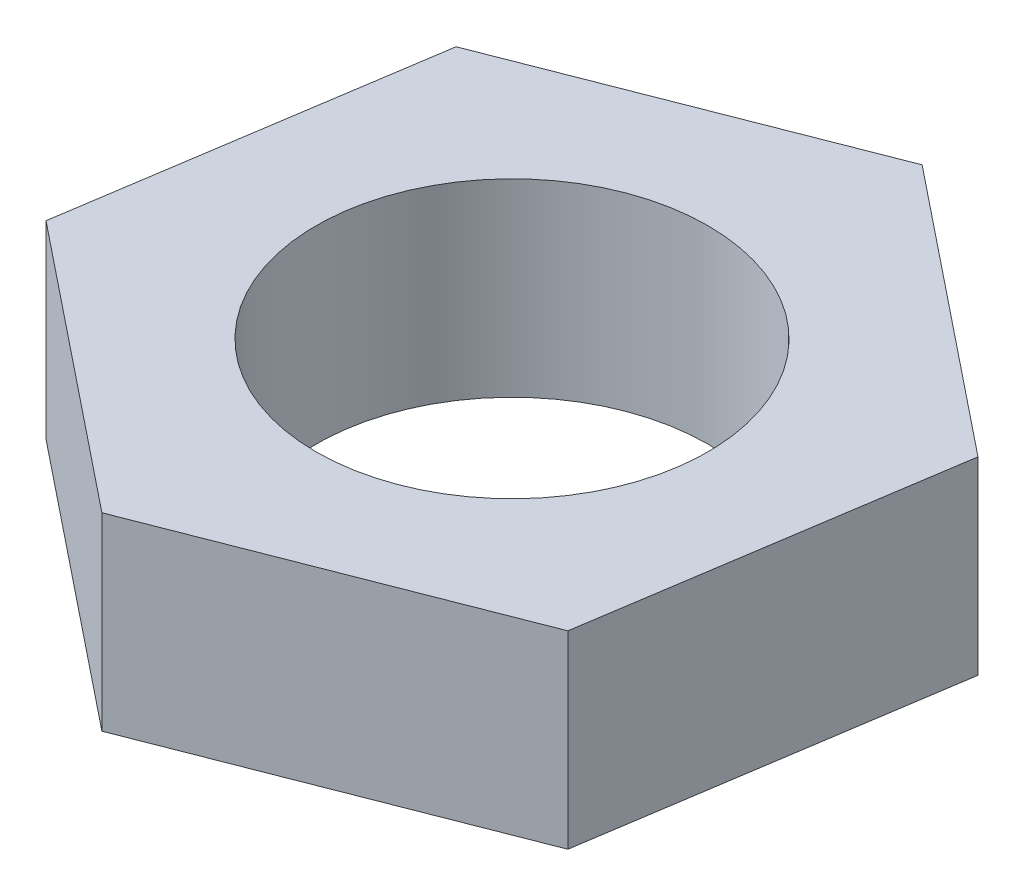
ISO-10303-21;
HEADER;
FILE_DESCRIPTION(('STEP AP214'),'2;1');
FILE_NAME('part.step','',(''),(''),'','','');
FILE_SCHEMA(('AUTOMOTIVE_DESIGN { 1 0 10303 214 1 1 1 1 }'));
ENDSEC;
DATA;
#1=APPLICATION_CONTEXT('core data for automotive mechanical design processes');
#2=APPLICATION_PROTOCOL_DEFINITION('international standard','automotive_design',2000,#1);
#3=PRODUCT_CONTEXT('',#1,'mechanical');
#4=PRODUCT('Part','Part','',(#3));
#5=PRODUCT_RELATED_PRODUCT_CATEGORY('part','',(#4));
#6=PRODUCT_DEFINITION_FORMATION('','',#4);
#7=PRODUCT_DEFINITION_CONTEXT('part definition',#1,'design');
#8=PRODUCT_DEFINITION('design','',#6,#7);
#9=PRODUCT_DEFINITION_SHAPE('','',#8);
#10=(LENGTH_UNIT() NAMED_UNIT(*) SI_UNIT(.MILLI.,.METRE.));
#11=(NAMED_UNIT(*) PLANE_ANGLE_UNIT() SI_UNIT($,.RADIAN.));
#12=(NAMED_UNIT(*) SI_UNIT($,.STERADIAN.) SOLID_ANGLE_UNIT());
#13=UNCERTAINTY_MEASURE_WITH_UNIT(LENGTH_MEASURE(1.E-05),#10,'distance_accuracy_value','');
#14=(GEOMETRIC_REPRESENTATION_CONTEXT(3) GLOBAL_UNCERTAINTY_ASSIGNED_CONTEXT((#13)) GLOBAL_UNIT_ASSIGNED_CONTEXT((#10,
#11,#12)) REPRESENTATION_CONTEXT('',''));
#15=CARTESIAN_POINT('',(0.,0.,0.));
#16=DIRECTION('',(0.,0.,1.));
#17=DIRECTION('',(1.,0.,0.));
#18=AXIS2_PLACEMENT_3D('',#15,#16,#17);
#19=CARTESIAN_POINT('',(-10.3923048454133,7.,-8.32408394547586));
#20=DIRECTION('',(0.988509150519784,0.,0.151161037766536));
#21=DIRECTION('',(0.151161037766536,0.,-0.988509150519784));
#22=AXIS2_PLACEMENT_3D('',#19,#20,#21);
#23=PLANE('',#22);
#24=DIRECTION('',(-0.151161037766536,0.,0.988509150519783));
#25=VECTOR('',#24,1.);
#26=CARTESIAN_POINT('',(-10.3923048454133,0.,-8.32408394547586));
#27=LINE('',#26,#25);
#28=CARTESIAN_POINT('',(-10.3923048454133,0.,-8.32408394547586));
#29=VERTEX_POINT('',#28);
#30=CARTESIAN_POINT('',(-12.4050205827229,0.,4.83795802726207));
#31=VERTEX_POINT('',#30);
#32=EDGE_CURVE('E118',#29,#31,#27,.T.);
#33=ORIENTED_EDGE('',*,*,#32,.T.);
#34=DIRECTION('',(0.,-1.,0.));
#35=VECTOR('',#34,1.);
#36=CARTESIAN_POINT('',(-12.4050205827229,7.,4.83795802726207));
#37=LINE('',#36,#35);
#38=CARTESIAN_POINT('',(-12.4050205827229,7.,4.83795802726207));
#39=VERTEX_POINT('',#38);
#40=EDGE_CURVE('E11',#39,#31,#37,.T.);
#41=ORIENTED_EDGE('',*,*,#40,.F.);
#42=DIRECTION('',(-0.151161037766536,0.,0.988509150519783));
#43=VECTOR('',#42,1.);
#44=CARTESIAN_POINT('',(-10.3923048454133,7.,-8.32408394547586));
#45=LINE('',#44,#43);
#46=CARTESIAN_POINT('',(-10.3923048454133,7.,-8.32408394547586));
#47=VERTEX_POINT('',#46);
#48=EDGE_CURVE('E129',#47,#39,#45,.T.);
#49=ORIENTED_EDGE('',*,*,#48,.F.);
#50=DIRECTION('',(0.,-1.,0.));
#51=VECTOR('',#50,1.);
#52=CARTESIAN_POINT('',(-10.3923048454133,7.,-8.32408394547586));
#53=LINE('',#52,#51);
#54=EDGE_CURVE('E114',#47,#29,#53,.T.);
#55=ORIENTED_EDGE('',*,*,#54,.T.);
#56=EDGE_LOOP('',(#33,#41,#49,#55));
#57=FACE_BOUND('',#56,.T.);
#58=ADVANCED_FACE('F34',(#57),#23,.F.);
#59=CARTESIAN_POINT('',(-12.4050205827229,7.,4.83795802726207));
#60=DIRECTION('',(0.625163874028131,0.,-0.78049351734024));
#61=DIRECTION('',(-0.78049351734024,0.,-0.625163874028131));
#62=AXIS2_PLACEMENT_3D('',#59,#60,#61);
#63=PLANE('',#62);
#64=DIRECTION('',(0.78049351734024,0.,0.625163874028131));
#65=VECTOR('',#64,1.);
#66=CARTESIAN_POINT('',(-12.4050205827229,0.,4.83795802726207));
#67=LINE('',#66,#65);
#68=CARTESIAN_POINT('',(-2.01271573730966,0.,13.1620419727379));
#69=VERTEX_POINT('',#68);
#70=EDGE_CURVE('E121',#31,#69,#67,.T.);
#71=ORIENTED_EDGE('',*,*,#70,.T.);
#72=DIRECTION('',(0.,-1.,0.));
#73=VECTOR('',#72,1.);
#74=CARTESIAN_POINT('',(-2.01271573730966,7.,13.1620419727379));
#75=LINE('',#74,#73);
#76=CARTESIAN_POINT('',(-2.01271573730966,7.,13.1620419727379));
#77=VERTEX_POINT('',#76);
#78=EDGE_CURVE('E42',#77,#69,#75,.T.);
#79=ORIENTED_EDGE('',*,*,#78,.F.);
#80=DIRECTION('',(0.78049351734024,0.,0.625163874028131));
#81=VECTOR('',#80,1.);
#82=CARTESIAN_POINT('',(-12.4050205827229,7.,4.83795802726207));
#83=LINE('',#82,#81);
#84=EDGE_CURVE('E87',#39,#77,#83,.T.);
#85=ORIENTED_EDGE('',*,*,#84,.F.);
#86=ORIENTED_EDGE('',*,*,#40,.T.);
#87=EDGE_LOOP('',(#71,#79,#85,#86));
#88=FACE_BOUND('',#87,.T.);
#89=ADVANCED_FACE('F154',(#88),#63,.F.);
#90=CARTESIAN_POINT('',(-2.01271573730966,7.,13.1620419727379));
#91=DIRECTION('',(-0.363345276491653,0.,-0.931654555106776));
#92=DIRECTION('',(-0.931654555106776,0.,0.363345276491653));
#93=AXIS2_PLACEMENT_3D('',#90,#91,#92);
#94=PLANE('',#93);
#95=DIRECTION('',(0.931654555106776,0.,-0.363345276491653));
#96=VECTOR('',#95,1.);
#97=CARTESIAN_POINT('',(-2.01271573730966,0.,13.1620419727379));
#98=LINE('',#97,#96);
#99=CARTESIAN_POINT('',(10.3923048454133,0.,8.32408394547585));
#100=VERTEX_POINT('',#99);
#101=EDGE_CURVE('E124',#69,#100,#98,.T.);
#102=ORIENTED_EDGE('',*,*,#101,.T.);
#103=DIRECTION('',(0.,-1.,0.));
#104=VECTOR('',#103,1.);
#105=CARTESIAN_POINT('',(10.3923048454133,7.,8.32408394547585));
#106=LINE('',#105,#104);
#107=CARTESIAN_POINT('',(10.3923048454133,7.,8.32408394547585));
#108=VERTEX_POINT('',#107);
#109=EDGE_CURVE('E109',#108,#100,#106,.T.);
#110=ORIENTED_EDGE('',*,*,#109,.F.);
#111=DIRECTION('',(0.931654555106776,0.,-0.363345276491653));
#112=VECTOR('',#111,1.);
#113=CARTESIAN_POINT('',(-2.01271573730966,7.,13.1620419727379));
#114=LINE('',#113,#112);
#115=EDGE_CURVE('E100',#77,#108,#114,.T.);
#116=ORIENTED_EDGE('',*,*,#115,.F.);
#117=ORIENTED_EDGE('',*,*,#78,.T.);
#118=EDGE_LOOP('',(#102,#110,#116,#117));
#119=FACE_BOUND('',#118,.T.);
#120=ADVANCED_FACE('F135',(#119),#94,.F.);
#121=CARTESIAN_POINT('',(10.3923048454133,7.,8.32408394547585));
#122=DIRECTION('',(-0.988509150519783,0.,-0.151161037766536));
#123=DIRECTION('',(-0.151161037766536,0.,0.988509150519783));
#124=AXIS2_PLACEMENT_3D('',#121,#122,#123);
#125=PLANE('',#124);
#126=DIRECTION('',(0.151161037766536,0.,-0.988509150519784));
#127=VECTOR('',#126,1.);
#128=CARTESIAN_POINT('',(10.3923048454133,0.,8.32408394547585));
#129=LINE('',#128,#127);
#130=CARTESIAN_POINT('',(12.4050205827229,0.,-4.83795802726207));
#131=VERTEX_POINT('',#130);
#132=EDGE_CURVE('E108',#100,#131,#129,.T.);
#133=ORIENTED_EDGE('',*,*,#132,.T.);
#134=DIRECTION('',(0.,-1.,0.));
#135=VECTOR('',#134,1.);
#136=CARTESIAN_POINT('',(12.4050205827229,7.,-4.83795802726207));
#137=LINE('',#136,#135);
#138=CARTESIAN_POINT('',(12.4050205827229,7.,-4.83795802726207));
#139=VERTEX_POINT('',#138);
#140=EDGE_CURVE('E105',#139,#131,#137,.T.);
#141=ORIENTED_EDGE('',*,*,#140,.F.);
#142=DIRECTION('',(0.151161037766536,0.,-0.988509150519784));
#143=VECTOR('',#142,1.);
#144=CARTESIAN_POINT('',(10.3923048454133,7.,8.32408394547585));
#145=LINE('',#144,#143);
#146=EDGE_CURVE('E94',#108,#139,#145,.T.);
#147=ORIENTED_EDGE('',*,*,#146,.F.);
#148=ORIENTED_EDGE('',*,*,#109,.T.);
#149=EDGE_LOOP('',(#133,#141,#147,#148));
#150=FACE_BOUND('',#149,.T.);
#151=ADVANCED_FACE('F106',(#150),#125,.F.);
#152=CARTESIAN_POINT('',(12.4050205827229,7.,-4.83795802726207));
#153=DIRECTION('',(-0.625163874028131,0.,0.78049351734024));
#154=DIRECTION('',(0.78049351734024,0.,0.625163874028131));
#155=AXIS2_PLACEMENT_3D('',#152,#153,#154);
#156=PLANE('',#155);
#157=DIRECTION('',(-0.78049351734024,0.,-0.625163874028131));
#158=VECTOR('',#157,1.);
#159=CARTESIAN_POINT('',(12.4050205827229,0.,-4.83795802726207));
#160=LINE('',#159,#158);
#161=CARTESIAN_POINT('',(2.01271573730966,0.,-13.1620419727379));
#162=VERTEX_POINT('',#161);
#163=EDGE_CURVE('E73',#131,#162,#160,.T.);
#164=ORIENTED_EDGE('',*,*,#163,.T.);
#165=DIRECTION('',(0.,-1.,0.));
#166=VECTOR('',#165,1.);
#167=CARTESIAN_POINT('',(2.01271573730966,7.,-13.1620419727379));
#168=LINE('',#167,#166);
#169=CARTESIAN_POINT('',(2.01271573730966,7.,-13.1620419727379));
#170=VERTEX_POINT('',#169);
#171=EDGE_CURVE('E110',#170,#162,#168,.T.);
#172=ORIENTED_EDGE('',*,*,#171,.F.);
#173=DIRECTION('',(-0.78049351734024,0.,-0.625163874028131));
#174=VECTOR('',#173,1.);
#175=CARTESIAN_POINT('',(12.4050205827229,7.,-4.83795802726207));
#176=LINE('',#175,#174);
#177=EDGE_CURVE('E98',#139,#170,#176,.T.);
#178=ORIENTED_EDGE('',*,*,#177,.F.);
#179=ORIENTED_EDGE('',*,*,#140,.T.);
#180=EDGE_LOOP('',(#164,#172,#178,#179));
#181=FACE_BOUND('',#180,.T.);
#182=ADVANCED_FACE('F112',(#181),#156,.F.);
#183=CARTESIAN_POINT('',(2.01271573730966,7.,-13.1620419727379));
#184=DIRECTION('',(0.363345276491652,0.,0.931654555106776));
#185=DIRECTION('',(0.931654555106776,0.,-0.363345276491652));
#186=AXIS2_PLACEMENT_3D('',#183,#184,#185);
#187=PLANE('',#186);
#188=DIRECTION('',(-0.931654555106776,0.,0.363345276491652));
#189=VECTOR('',#188,1.);
#190=CARTESIAN_POINT('',(2.01271573730966,0.,-13.1620419727379));
#191=LINE('',#190,#189);
#192=EDGE_CURVE('E79',#162,#29,#191,.T.);
#193=ORIENTED_EDGE('',*,*,#192,.T.);
#194=ORIENTED_EDGE('',*,*,#54,.F.);
#195=DIRECTION('',(-0.931654555106776,0.,0.363345276491652));
#196=VECTOR('',#195,1.);
#197=CARTESIAN_POINT('',(2.01271573730966,7.,-13.1620419727379));
#198=LINE('',#197,#196);
#199=EDGE_CURVE('E50',#170,#47,#198,.T.);
#200=ORIENTED_EDGE('',*,*,#199,.F.);
#201=ORIENTED_EDGE('',*,*,#171,.T.);
#202=EDGE_LOOP('',(#193,#194,#200,#201));
#203=FACE_BOUND('',#202,.T.);
#204=ADVANCED_FACE('F142',(#203),#187,.F.);
#205=CARTESIAN_POINT('',(0.,7.,0.));
#206=DIRECTION('',(0.,1.,0.));
#207=DIRECTION('',(0.,0.,1.));
#208=AXIS2_PLACEMENT_3D('',#205,#206,#207);
#209=PLANE('',#208);
#210=CARTESIAN_POINT('',(0.,7.,0.));
#211=DIRECTION('',(0.,1.,0.));
#212=DIRECTION('',(0.,0.,1.));
#213=AXIS2_PLACEMENT_3D('',#210,#211,#212);
#214=CIRCLE('',#213,7.25);
#215=CARTESIAN_POINT('',(0.,7.,7.25));
#216=VERTEX_POINT('',#215);
#217=EDGE_CURVE('E211',#216,#216,#214,.T.);
#218=ORIENTED_EDGE('',*,*,#217,.F.);
#219=EDGE_LOOP('',(#218));
#220=FACE_BOUND('',#219,.T.);
#221=ORIENTED_EDGE('',*,*,#48,.T.);
#222=ORIENTED_EDGE('',*,*,#84,.T.);
#223=ORIENTED_EDGE('',*,*,#115,.T.);
#224=ORIENTED_EDGE('',*,*,#146,.T.);
#225=ORIENTED_EDGE('',*,*,#177,.T.);
#226=ORIENTED_EDGE('',*,*,#199,.T.);
#227=EDGE_LOOP('',(#221,#222,#223,#224,#225,#226));
#228=FACE_BOUND('',#227,.T.);
#229=ADVANCED_FACE('F96',(#220,#228),#209,.T.);
#230=CARTESIAN_POINT('',(0.,0.,0.));
#231=DIRECTION('',(0.,1.,0.));
#232=DIRECTION('',(0.,0.,1.));
#233=AXIS2_PLACEMENT_3D('',#230,#231,#232);
#234=PLANE('',#233);
#235=CARTESIAN_POINT('',(0.,0.,0.));
#236=DIRECTION('',(0.,1.,0.));
#237=DIRECTION('',(0.,0.,1.));
#238=AXIS2_PLACEMENT_3D('',#235,#236,#237);
#239=CIRCLE('',#238,7.25);
#240=CARTESIAN_POINT('',(0.,0.,7.25));
#241=VERTEX_POINT('',#240);
#242=EDGE_CURVE('E122',#241,#241,#239,.T.);
#243=ORIENTED_EDGE('',*,*,#242,.T.);
#244=EDGE_LOOP('',(#243));
#245=FACE_BOUND('',#244,.T.);
#246=ORIENTED_EDGE('',*,*,#32,.F.);
#247=ORIENTED_EDGE('',*,*,#192,.F.);
#248=ORIENTED_EDGE('',*,*,#163,.F.);
#249=ORIENTED_EDGE('',*,*,#132,.F.);
#250=ORIENTED_EDGE('',*,*,#101,.F.);
#251=ORIENTED_EDGE('',*,*,#70,.F.);
#252=EDGE_LOOP('',(#246,#247,#248,#249,#250,#251));
#253=FACE_BOUND('',#252,.T.);
#254=ADVANCED_FACE('F138',(#245,#253),#234,.F.);
#255=CARTESIAN_POINT('',(0.,0.,0.));
#256=DIRECTION('',(0.,1.,0.));
#257=DIRECTION('',(0.,0.,1.));
#258=AXIS2_PLACEMENT_3D('',#255,#256,#257);
#259=CYLINDRICAL_SURFACE('',#258,7.25);
#260=ORIENTED_EDGE('',*,*,#242,.F.);
#261=EDGE_LOOP('',(#260));
#262=FACE_BOUND('',#261,.T.);
#263=ORIENTED_EDGE('',*,*,#217,.T.);
#264=EDGE_LOOP('',(#263));
#265=FACE_BOUND('',#264,.T.);
#266=ADVANCED_FACE('F191',(#262,#265),#259,.F.);
#267=CLOSED_SHELL('',(#58,#89,#120,#151,#182,#204,#229,#254,#266));
#268=MANIFOLD_SOLID_BREP('B2',#267);
#269=ADVANCED_BREP_SHAPE_REPRESENTATION('',(#18,#268),#14);
#270=SHAPE_DEFINITION_REPRESENTATION(#9,#269);
ENDSEC;
END-ISO-10303-21;
